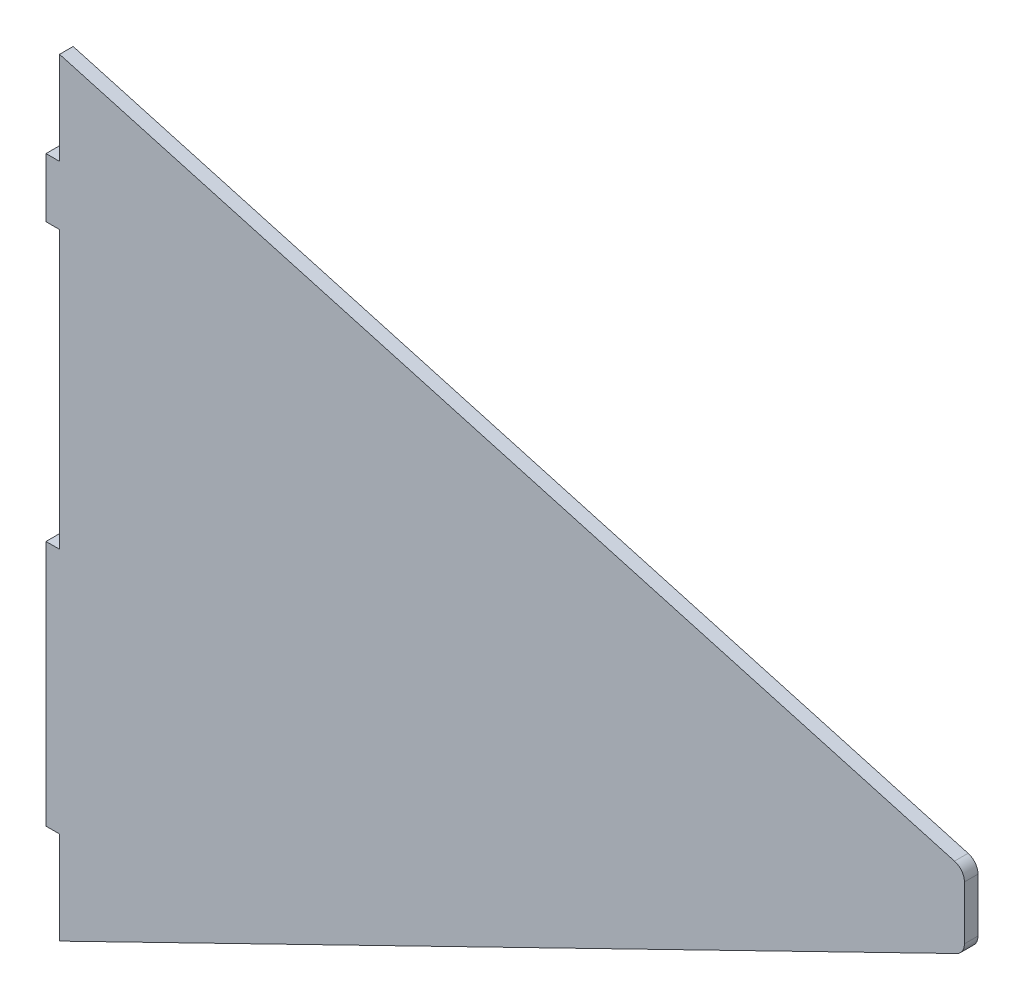
ISO-10303-21;
HEADER;
FILE_DESCRIPTION(('STEP AP214'),'2;1');
FILE_NAME('part.step','',(''),(''),'','','');
FILE_SCHEMA(('AUTOMOTIVE_DESIGN { 1 0 10303 214 1 1 1 1 }'));
ENDSEC;
DATA;
#1=APPLICATION_CONTEXT('core data for automotive mechanical design processes');
#2=APPLICATION_PROTOCOL_DEFINITION('international standard','automotive_design',2000,#1);
#3=PRODUCT_CONTEXT('',#1,'mechanical');
#4=PRODUCT('Part','Part','',(#3));
#5=PRODUCT_RELATED_PRODUCT_CATEGORY('part','',(#4));
#6=PRODUCT_DEFINITION_FORMATION('','',#4);
#7=PRODUCT_DEFINITION_CONTEXT('part definition',#1,'design');
#8=PRODUCT_DEFINITION('design','',#6,#7);
#9=PRODUCT_DEFINITION_SHAPE('','',#8);
#10=(LENGTH_UNIT() NAMED_UNIT(*) SI_UNIT(.MILLI.,.METRE.));
#11=(NAMED_UNIT(*) PLANE_ANGLE_UNIT() SI_UNIT($,.RADIAN.));
#12=(NAMED_UNIT(*) SI_UNIT($,.STERADIAN.) SOLID_ANGLE_UNIT());
#13=UNCERTAINTY_MEASURE_WITH_UNIT(LENGTH_MEASURE(1.E-05),#10,'distance_accuracy_value','');
#14=(GEOMETRIC_REPRESENTATION_CONTEXT(3) GLOBAL_UNCERTAINTY_ASSIGNED_CONTEXT((#13)) GLOBAL_UNIT_ASSIGNED_CONTEXT((#10,
#11,#12)) REPRESENTATION_CONTEXT('',''));
#15=CARTESIAN_POINT('',(0.,0.,0.));
#16=DIRECTION('',(0.,0.,1.));
#17=DIRECTION('',(1.,0.,0.));
#18=AXIS2_PLACEMENT_3D('',#15,#16,#17);
#19=CARTESIAN_POINT('',(203.,-48.8499999999948,3.));
#20=DIRECTION('',(-1.,0.,0.));
#21=DIRECTION('',(0.,-1.,0.));
#22=AXIS2_PLACEMENT_3D('',#19,#20,#21);
#23=PLANE('',#22);
#24=DIRECTION('',(0.,1.,0.));
#25=VECTOR('',#24,1.);
#26=CARTESIAN_POINT('',(203.,-48.8499999999948,0.));
#27=LINE('',#26,#25);
#28=CARTESIAN_POINT('',(203.,-46.9758424243253,0.));
#29=VERTEX_POINT('',#28);
#30=CARTESIAN_POINT('',(203.,-35.1237386171915,0.));
#31=VERTEX_POINT('',#30);
#32=EDGE_CURVE('E186',#29,#31,#27,.T.);
#33=ORIENTED_EDGE('',*,*,#32,.T.);
#34=DIRECTION('',(0.,0.,-1.));
#35=VECTOR('',#34,1.);
#36=CARTESIAN_POINT('',(203.,-35.1237386171915,3.));
#37=LINE('',#36,#35);
#38=CARTESIAN_POINT('',(203.,-35.1237386171915,3.));
#39=VERTEX_POINT('',#38);
#40=EDGE_CURVE('E58',#31,#39,#37,.F.);
#41=ORIENTED_EDGE('',*,*,#40,.T.);
#42=DIRECTION('',(0.,1.,0.));
#43=VECTOR('',#42,1.);
#44=CARTESIAN_POINT('',(203.,-48.8499999999948,3.));
#45=LINE('',#44,#43);
#46=CARTESIAN_POINT('',(203.,-46.9758424243253,3.));
#47=VERTEX_POINT('',#46);
#48=EDGE_CURVE('E149',#47,#39,#45,.T.);
#49=ORIENTED_EDGE('',*,*,#48,.F.);
#50=DIRECTION('',(0.,0.,-1.));
#51=VECTOR('',#50,1.);
#52=CARTESIAN_POINT('',(203.,-46.9758424243253,3.));
#53=LINE('',#52,#51);
#54=EDGE_CURVE('E238',#47,#29,#53,.T.);
#55=ORIENTED_EDGE('',*,*,#54,.T.);
#56=EDGE_LOOP('',(#33,#41,#49,#55));
#57=FACE_BOUND('',#56,.T.);
#58=ADVANCED_FACE('F37',(#57),#23,.F.);
#59=CARTESIAN_POINT('',(203.,-32.8499999999948,3.));
#60=DIRECTION('',(-0.270299446972253,-0.962776302661472,0.));
#61=DIRECTION('',(0.962776302661472,-0.270299446972253,0.));
#62=AXIS2_PLACEMENT_3D('',#59,#60,#61);
#63=PLANE('',#62);
#64=DIRECTION('',(-0.962776302661472,0.270299446972253,0.));
#65=VECTOR('',#64,1.);
#66=CARTESIAN_POINT('',(203.,-32.8499999999948,3.));
#67=LINE('',#66,#65);
#68=CARTESIAN_POINT('',(200.810898340917,-32.2354097092071,3.));
#69=VERTEX_POINT('',#68);
#70=CARTESIAN_POINT('',(3.,23.3000000000144,3.));
#71=VERTEX_POINT('',#70);
#72=EDGE_CURVE('E139',#69,#71,#67,.T.);
#73=ORIENTED_EDGE('',*,*,#72,.F.);
#74=DIRECTION('',(0.,0.,-1.));
#75=VECTOR('',#74,1.);
#76=CARTESIAN_POINT('',(200.810898340917,-32.2354097092071,3.));
#77=LINE('',#76,#75);
#78=CARTESIAN_POINT('',(200.810898340917,-32.2354097092071,0.));
#79=VERTEX_POINT('',#78);
#80=EDGE_CURVE('E158',#69,#79,#77,.T.);
#81=ORIENTED_EDGE('',*,*,#80,.T.);
#82=DIRECTION('',(-0.962776302661472,0.270299446972253,0.));
#83=VECTOR('',#82,1.);
#84=CARTESIAN_POINT('',(203.,-32.8499999999948,0.));
#85=LINE('',#84,#83);
#86=CARTESIAN_POINT('',(3.,23.3000000000144,0.));
#87=VERTEX_POINT('',#86);
#88=EDGE_CURVE('E155',#79,#87,#85,.T.);
#89=ORIENTED_EDGE('',*,*,#88,.T.);
#90=DIRECTION('',(0.,0.,-1.));
#91=VECTOR('',#90,1.);
#92=CARTESIAN_POINT('',(3.,23.3000000000144,3.));
#93=LINE('',#92,#91);
#94=EDGE_CURVE('E152',#71,#87,#93,.T.);
#95=ORIENTED_EDGE('',*,*,#94,.F.);
#96=EDGE_LOOP('',(#73,#81,#89,#95));
#97=FACE_BOUND('',#96,.T.);
#98=ADVANCED_FACE('F153',(#97),#63,.F.);
#99=CARTESIAN_POINT('',(3.,23.3000000000144,3.));
#100=DIRECTION('',(1.,0.,0.));
#101=DIRECTION('',(0.,1.,0.));
#102=AXIS2_PLACEMENT_3D('',#99,#100,#101);
#103=PLANE('',#102);
#104=DIRECTION('',(0.,-1.,0.));
#105=VECTOR('',#104,1.);
#106=CARTESIAN_POINT('',(3.,23.3000000000144,0.));
#107=LINE('',#106,#105);
#108=CARTESIAN_POINT('',(2.99999999999999,2.80000000001442,0.));
#109=VERTEX_POINT('',#108);
#110=EDGE_CURVE('E189',#87,#109,#107,.T.);
#111=ORIENTED_EDGE('',*,*,#110,.T.);
#112=DIRECTION('',(0.,0.,-1.));
#113=VECTOR('',#112,1.);
#114=CARTESIAN_POINT('',(2.99999999999999,2.80000000001442,3.));
#115=LINE('',#114,#113);
#116=CARTESIAN_POINT('',(2.99999999999999,2.80000000001442,3.));
#117=VERTEX_POINT('',#116);
#118=EDGE_CURVE('E159',#117,#109,#115,.T.);
#119=ORIENTED_EDGE('',*,*,#118,.F.);
#120=DIRECTION('',(0.,-1.,0.));
#121=VECTOR('',#120,1.);
#122=CARTESIAN_POINT('',(3.,23.3000000000144,3.));
#123=LINE('',#122,#121);
#124=EDGE_CURVE('E143',#71,#117,#123,.T.);
#125=ORIENTED_EDGE('',*,*,#124,.F.);
#126=ORIENTED_EDGE('',*,*,#94,.T.);
#127=EDGE_LOOP('',(#111,#119,#125,#126));
#128=FACE_BOUND('',#127,.T.);
#129=ADVANCED_FACE('F161',(#128),#103,.F.);
#130=CARTESIAN_POINT('',(2.99999999999999,2.80000000001442,3.));
#131=DIRECTION('',(0.,-1.,0.));
#132=DIRECTION('',(0.,0.,-1.));
#133=AXIS2_PLACEMENT_3D('',#130,#131,#132);
#134=PLANE('',#133);
#135=DIRECTION('',(-1.,0.,0.));
#136=VECTOR('',#135,1.);
#137=CARTESIAN_POINT('',(2.99999999999999,2.80000000001442,0.));
#138=LINE('',#137,#136);
#139=CARTESIAN_POINT('',(0.,2.80000000001442,0.));
#140=VERTEX_POINT('',#139);
#141=EDGE_CURVE('E191',#109,#140,#138,.T.);
#142=ORIENTED_EDGE('',*,*,#141,.T.);
#143=DIRECTION('',(0.,0.,-1.));
#144=VECTOR('',#143,1.);
#145=CARTESIAN_POINT('',(0.,2.80000000001442,3.));
#146=LINE('',#145,#144);
#147=CARTESIAN_POINT('',(0.,2.80000000001442,3.));
#148=VERTEX_POINT('',#147);
#149=EDGE_CURVE('E229',#148,#140,#146,.T.);
#150=ORIENTED_EDGE('',*,*,#149,.F.);
#151=DIRECTION('',(-1.,0.,0.));
#152=VECTOR('',#151,1.);
#153=CARTESIAN_POINT('',(2.99999999999999,2.80000000001442,3.));
#154=LINE('',#153,#152);
#155=EDGE_CURVE('E164',#117,#148,#154,.T.);
#156=ORIENTED_EDGE('',*,*,#155,.F.);
#157=ORIENTED_EDGE('',*,*,#118,.T.);
#158=EDGE_LOOP('',(#142,#150,#156,#157));
#159=FACE_BOUND('',#158,.T.);
#160=ADVANCED_FACE('F289',(#159),#134,.F.);
#161=CARTESIAN_POINT('',(0.,2.80000000001442,3.));
#162=DIRECTION('',(1.,0.,0.));
#163=DIRECTION('',(0.,1.,0.));
#164=AXIS2_PLACEMENT_3D('',#161,#162,#163);
#165=PLANE('',#164);
#166=DIRECTION('',(0.,-1.,0.));
#167=VECTOR('',#166,1.);
#168=CARTESIAN_POINT('',(0.,2.80000000001442,0.));
#169=LINE('',#168,#167);
#170=CARTESIAN_POINT('',(0.,-10.2499999999947,0.));
#171=VERTEX_POINT('',#170);
#172=EDGE_CURVE('E193',#140,#171,#169,.T.);
#173=ORIENTED_EDGE('',*,*,#172,.T.);
#174=DIRECTION('',(0.,0.,-1.));
#175=VECTOR('',#174,1.);
#176=CARTESIAN_POINT('',(0.,-10.2499999999947,3.));
#177=LINE('',#176,#175);
#178=CARTESIAN_POINT('',(0.,-10.2499999999947,3.));
#179=VERTEX_POINT('',#178);
#180=EDGE_CURVE('E226',#179,#171,#177,.T.);
#181=ORIENTED_EDGE('',*,*,#180,.F.);
#182=DIRECTION('',(0.,-1.,0.));
#183=VECTOR('',#182,1.);
#184=CARTESIAN_POINT('',(0.,2.80000000001442,3.));
#185=LINE('',#184,#183);
#186=EDGE_CURVE('E166',#148,#179,#185,.T.);
#187=ORIENTED_EDGE('',*,*,#186,.F.);
#188=ORIENTED_EDGE('',*,*,#149,.T.);
#189=EDGE_LOOP('',(#173,#181,#187,#188));
#190=FACE_BOUND('',#189,.T.);
#191=ADVANCED_FACE('F285',(#190),#165,.F.);
#192=CARTESIAN_POINT('',(0.,-10.2499999999947,3.));
#193=DIRECTION('',(0.,1.,0.));
#194=DIRECTION('',(0.,0.,1.));
#195=AXIS2_PLACEMENT_3D('',#192,#193,#194);
#196=PLANE('',#195);
#197=DIRECTION('',(1.,0.,0.));
#198=VECTOR('',#197,1.);
#199=CARTESIAN_POINT('',(0.,-10.2499999999947,0.));
#200=LINE('',#199,#198);
#201=CARTESIAN_POINT('',(3.,-10.2499999999947,0.));
#202=VERTEX_POINT('',#201);
#203=EDGE_CURVE('E195',#171,#202,#200,.T.);
#204=ORIENTED_EDGE('',*,*,#203,.T.);
#205=DIRECTION('',(0.,0.,-1.));
#206=VECTOR('',#205,1.);
#207=CARTESIAN_POINT('',(3.,-10.2499999999947,3.));
#208=LINE('',#207,#206);
#209=CARTESIAN_POINT('',(3.,-10.2499999999947,3.));
#210=VERTEX_POINT('',#209);
#211=EDGE_CURVE('E223',#210,#202,#208,.T.);
#212=ORIENTED_EDGE('',*,*,#211,.F.);
#213=DIRECTION('',(1.,0.,0.));
#214=VECTOR('',#213,1.);
#215=CARTESIAN_POINT('',(0.,-10.2499999999947,3.));
#216=LINE('',#215,#214);
#217=EDGE_CURVE('E171',#179,#210,#216,.T.);
#218=ORIENTED_EDGE('',*,*,#217,.F.);
#219=ORIENTED_EDGE('',*,*,#180,.T.);
#220=EDGE_LOOP('',(#204,#212,#218,#219));
#221=FACE_BOUND('',#220,.T.);
#222=ADVANCED_FACE('F281',(#221),#196,.F.);
#223=CARTESIAN_POINT('',(3.,-10.2499999999947,3.));
#224=DIRECTION('',(1.,0.,0.));
#225=DIRECTION('',(0.,1.,0.));
#226=AXIS2_PLACEMENT_3D('',#223,#224,#225);
#227=PLANE('',#226);
#228=DIRECTION('',(0.,-1.,0.));
#229=VECTOR('',#228,1.);
#230=CARTESIAN_POINT('',(3.,-10.2499999999947,0.));
#231=LINE('',#230,#229);
#232=CARTESIAN_POINT('',(3.,-71.4499999999946,0.));
#233=VERTEX_POINT('',#232);
#234=EDGE_CURVE('E197',#202,#233,#231,.T.);
#235=ORIENTED_EDGE('',*,*,#234,.T.);
#236=DIRECTION('',(0.,0.,-1.));
#237=VECTOR('',#236,1.);
#238=CARTESIAN_POINT('',(3.,-71.4499999999946,3.));
#239=LINE('',#238,#237);
#240=CARTESIAN_POINT('',(3.,-71.4499999999946,3.));
#241=VERTEX_POINT('',#240);
#242=EDGE_CURVE('E220',#241,#233,#239,.T.);
#243=ORIENTED_EDGE('',*,*,#242,.F.);
#244=DIRECTION('',(0.,-1.,0.));
#245=VECTOR('',#244,1.);
#246=CARTESIAN_POINT('',(3.,-10.2499999999947,3.));
#247=LINE('',#246,#245);
#248=EDGE_CURVE('E173',#210,#241,#247,.T.);
#249=ORIENTED_EDGE('',*,*,#248,.F.);
#250=ORIENTED_EDGE('',*,*,#211,.T.);
#251=EDGE_LOOP('',(#235,#243,#249,#250));
#252=FACE_BOUND('',#251,.T.);
#253=ADVANCED_FACE('F276',(#252),#227,.F.);
#254=CARTESIAN_POINT('',(3.,-71.4499999999946,3.));
#255=DIRECTION('',(0.,-1.,0.));
#256=DIRECTION('',(0.,0.,-1.));
#257=AXIS2_PLACEMENT_3D('',#254,#255,#256);
#258=PLANE('',#257);
#259=DIRECTION('',(-1.,0.,0.));
#260=VECTOR('',#259,1.);
#261=CARTESIAN_POINT('',(3.,-71.4499999999946,0.));
#262=LINE('',#261,#260);
#263=CARTESIAN_POINT('',(0.,-71.4499999999946,0.));
#264=VERTEX_POINT('',#263);
#265=EDGE_CURVE('E199',#233,#264,#262,.T.);
#266=ORIENTED_EDGE('',*,*,#265,.T.);
#267=DIRECTION('',(0.,0.,-1.));
#268=VECTOR('',#267,1.);
#269=CARTESIAN_POINT('',(0.,-71.4499999999946,3.));
#270=LINE('',#269,#268);
#271=CARTESIAN_POINT('',(0.,-71.4499999999946,3.));
#272=VERTEX_POINT('',#271);
#273=EDGE_CURVE('E217',#272,#264,#270,.T.);
#274=ORIENTED_EDGE('',*,*,#273,.F.);
#275=DIRECTION('',(-1.,0.,0.));
#276=VECTOR('',#275,1.);
#277=CARTESIAN_POINT('',(3.,-71.4499999999946,3.));
#278=LINE('',#277,#276);
#279=EDGE_CURVE('E175',#241,#272,#278,.T.);
#280=ORIENTED_EDGE('',*,*,#279,.F.);
#281=ORIENTED_EDGE('',*,*,#242,.T.);
#282=EDGE_LOOP('',(#266,#274,#280,#281));
#283=FACE_BOUND('',#282,.T.);
#284=ADVANCED_FACE('F270',(#283),#258,.F.);
#285=CARTESIAN_POINT('',(0.,-71.4499999999946,3.));
#286=DIRECTION('',(1.,0.,0.));
#287=DIRECTION('',(0.,1.,0.));
#288=AXIS2_PLACEMENT_3D('',#285,#286,#287);
#289=PLANE('',#288);
#290=DIRECTION('',(0.,-1.,0.));
#291=VECTOR('',#290,1.);
#292=CARTESIAN_POINT('',(0.,-71.4499999999946,0.));
#293=LINE('',#292,#291);
#294=CARTESIAN_POINT('',(0.,-125.949999999995,0.));
#295=VERTEX_POINT('',#294);
#296=EDGE_CURVE('E201',#264,#295,#293,.T.);
#297=ORIENTED_EDGE('',*,*,#296,.T.);
#298=DIRECTION('',(0.,0.,-1.));
#299=VECTOR('',#298,1.);
#300=CARTESIAN_POINT('',(0.,-125.949999999995,3.));
#301=LINE('',#300,#299);
#302=CARTESIAN_POINT('',(0.,-125.949999999995,3.));
#303=VERTEX_POINT('',#302);
#304=EDGE_CURVE('E214',#303,#295,#301,.T.);
#305=ORIENTED_EDGE('',*,*,#304,.F.);
#306=DIRECTION('',(0.,-1.,0.));
#307=VECTOR('',#306,1.);
#308=CARTESIAN_POINT('',(0.,-71.4499999999946,3.));
#309=LINE('',#308,#307);
#310=EDGE_CURVE('E177',#272,#303,#309,.T.);
#311=ORIENTED_EDGE('',*,*,#310,.F.);
#312=ORIENTED_EDGE('',*,*,#273,.T.);
#313=EDGE_LOOP('',(#297,#305,#311,#312));
#314=FACE_BOUND('',#313,.T.);
#315=ADVANCED_FACE('F266',(#314),#289,.F.);
#316=CARTESIAN_POINT('',(0.,-125.949999999995,3.));
#317=DIRECTION('',(0.,1.,0.));
#318=DIRECTION('',(0.,0.,1.));
#319=AXIS2_PLACEMENT_3D('',#316,#317,#318);
#320=PLANE('',#319);
#321=DIRECTION('',(1.,0.,0.));
#322=VECTOR('',#321,1.);
#323=CARTESIAN_POINT('',(0.,-125.949999999995,0.));
#324=LINE('',#323,#322);
#325=CARTESIAN_POINT('',(3.00000000000001,-125.949999999995,0.));
#326=VERTEX_POINT('',#325);
#327=EDGE_CURVE('E203',#295,#326,#324,.T.);
#328=ORIENTED_EDGE('',*,*,#327,.T.);
#329=DIRECTION('',(0.,0.,-1.));
#330=VECTOR('',#329,1.);
#331=CARTESIAN_POINT('',(3.00000000000001,-125.949999999995,3.));
#332=LINE('',#331,#330);
#333=CARTESIAN_POINT('',(3.00000000000001,-125.949999999995,3.));
#334=VERTEX_POINT('',#333);
#335=EDGE_CURVE('E211',#334,#326,#332,.T.);
#336=ORIENTED_EDGE('',*,*,#335,.F.);
#337=DIRECTION('',(1.,0.,0.));
#338=VECTOR('',#337,1.);
#339=CARTESIAN_POINT('',(0.,-125.949999999995,3.));
#340=LINE('',#339,#338);
#341=EDGE_CURVE('E179',#303,#334,#340,.T.);
#342=ORIENTED_EDGE('',*,*,#341,.F.);
#343=ORIENTED_EDGE('',*,*,#304,.T.);
#344=EDGE_LOOP('',(#328,#336,#342,#343));
#345=FACE_BOUND('',#344,.T.);
#346=ADVANCED_FACE('F261',(#345),#320,.F.);
#347=CARTESIAN_POINT('',(3.00000000000001,-125.949999999995,3.));
#348=DIRECTION('',(1.,0.,0.));
#349=DIRECTION('',(0.,1.,0.));
#350=AXIS2_PLACEMENT_3D('',#347,#348,#349);
#351=PLANE('',#350);
#352=DIRECTION('',(0.,-1.,0.));
#353=VECTOR('',#352,1.);
#354=CARTESIAN_POINT('',(3.00000000000001,-125.949999999995,0.));
#355=LINE('',#354,#353);
#356=CARTESIAN_POINT('',(2.99999999999997,-146.449999999995,0.));
#357=VERTEX_POINT('',#356);
#358=EDGE_CURVE('E205',#326,#357,#355,.T.);
#359=ORIENTED_EDGE('',*,*,#358,.T.);
#360=DIRECTION('',(0.,0.,-1.));
#361=VECTOR('',#360,1.);
#362=CARTESIAN_POINT('',(2.99999999999997,-146.449999999995,3.));
#363=LINE('',#362,#361);
#364=CARTESIAN_POINT('',(2.99999999999997,-146.449999999995,3.));
#365=VERTEX_POINT('',#364);
#366=EDGE_CURVE('E185',#365,#357,#363,.T.);
#367=ORIENTED_EDGE('',*,*,#366,.F.);
#368=DIRECTION('',(0.,-1.,0.));
#369=VECTOR('',#368,1.);
#370=CARTESIAN_POINT('',(3.00000000000001,-125.949999999995,3.));
#371=LINE('',#370,#369);
#372=EDGE_CURVE('E181',#334,#365,#371,.T.);
#373=ORIENTED_EDGE('',*,*,#372,.F.);
#374=ORIENTED_EDGE('',*,*,#335,.T.);
#375=EDGE_LOOP('',(#359,#367,#373,#374));
#376=FACE_BOUND('',#375,.T.);
#377=ADVANCED_FACE('F255',(#376),#351,.F.);
#378=CARTESIAN_POINT('',(2.99999999999997,-146.449999999995,3.));
#379=DIRECTION('',(-0.438565276447849,0.898699336983299,0.));
#380=DIRECTION('',(-0.898699336983299,-0.438565276447849,0.));
#381=AXIS2_PLACEMENT_3D('',#378,#379,#380);
#382=PLANE('',#381);
#383=DIRECTION('',(0.898699336983299,0.438565276447849,0.));
#384=VECTOR('',#383,1.);
#385=CARTESIAN_POINT('',(2.99999999999997,-146.449999999995,0.));
#386=LINE('',#385,#384);
#387=CARTESIAN_POINT('',(201.315695829344,-49.6719404352752,0.));
#388=VERTEX_POINT('',#387);
#389=EDGE_CURVE('E207',#357,#388,#386,.T.);
#390=ORIENTED_EDGE('',*,*,#389,.T.);
#391=DIRECTION('',(0.,0.,-1.));
#392=VECTOR('',#391,1.);
#393=CARTESIAN_POINT('',(201.315695829344,-49.6719404352752,3.));
#394=LINE('',#393,#392);
#395=CARTESIAN_POINT('',(201.315695829344,-49.6719404352752,3.));
#396=VERTEX_POINT('',#395);
#397=EDGE_CURVE('E11',#388,#396,#394,.F.);
#398=ORIENTED_EDGE('',*,*,#397,.T.);
#399=DIRECTION('',(0.898699336983299,0.438565276447849,0.));
#400=VECTOR('',#399,1.);
#401=CARTESIAN_POINT('',(2.99999999999997,-146.449999999995,3.));
#402=LINE('',#401,#400);
#403=EDGE_CURVE('E183',#365,#396,#402,.T.);
#404=ORIENTED_EDGE('',*,*,#403,.F.);
#405=ORIENTED_EDGE('',*,*,#366,.T.);
#406=EDGE_LOOP('',(#390,#398,#404,#405));
#407=FACE_BOUND('',#406,.T.);
#408=ADVANCED_FACE('F251',(#407),#382,.F.);
#409=CARTESIAN_POINT('',(0.,0.,3.));
#410=DIRECTION('',(0.,0.,1.));
#411=DIRECTION('',(1.,0.,0.));
#412=AXIS2_PLACEMENT_3D('',#409,#410,#411);
#413=PLANE('',#412);
#414=ORIENTED_EDGE('',*,*,#48,.T.);
#415=CARTESIAN_POINT('',(200.,-35.1237386171915,3.));
#416=DIRECTION('',(0.,0.,1.));
#417=DIRECTION('',(1.,0.,0.));
#418=AXIS2_PLACEMENT_3D('',#415,#416,#417);
#419=CIRCLE('',#418,3.);
#420=EDGE_CURVE('E45',#39,#69,#419,.T.);
#421=ORIENTED_EDGE('',*,*,#420,.T.);
#422=ORIENTED_EDGE('',*,*,#72,.T.);
#423=ORIENTED_EDGE('',*,*,#124,.T.);
#424=ORIENTED_EDGE('',*,*,#155,.T.);
#425=ORIENTED_EDGE('',*,*,#186,.T.);
#426=ORIENTED_EDGE('',*,*,#217,.T.);
#427=ORIENTED_EDGE('',*,*,#248,.T.);
#428=ORIENTED_EDGE('',*,*,#279,.T.);
#429=ORIENTED_EDGE('',*,*,#310,.T.);
#430=ORIENTED_EDGE('',*,*,#341,.T.);
#431=ORIENTED_EDGE('',*,*,#372,.T.);
#432=ORIENTED_EDGE('',*,*,#403,.T.);
#433=CARTESIAN_POINT('',(200.,-46.9758424243253,3.));
#434=DIRECTION('',(0.,0.,1.));
#435=DIRECTION('',(1.,0.,0.));
#436=AXIS2_PLACEMENT_3D('',#433,#434,#435);
#437=CIRCLE('',#436,3.);
#438=EDGE_CURVE('E242',#396,#47,#437,.T.);
#439=ORIENTED_EDGE('',*,*,#438,.T.);
#440=EDGE_LOOP('',(#414,#421,#422,#423,#424,#425,#426,#427,#428,#429,#430,#431,#432,#439));
#441=FACE_BOUND('',#440,.T.);
#442=ADVANCED_FACE('F141',(#441),#413,.T.);
#443=CARTESIAN_POINT('',(0.,0.,0.));
#444=DIRECTION('',(0.,0.,1.));
#445=DIRECTION('',(1.,0.,0.));
#446=AXIS2_PLACEMENT_3D('',#443,#444,#445);
#447=PLANE('',#446);
#448=ORIENTED_EDGE('',*,*,#88,.F.);
#449=CARTESIAN_POINT('',(200.,-35.1237386171915,0.));
#450=DIRECTION('',(0.,0.,1.));
#451=DIRECTION('',(1.,0.,0.));
#452=AXIS2_PLACEMENT_3D('',#449,#450,#451);
#453=CIRCLE('',#452,3.);
#454=EDGE_CURVE('E236',#79,#31,#453,.F.);
#455=ORIENTED_EDGE('',*,*,#454,.T.);
#456=ORIENTED_EDGE('',*,*,#32,.F.);
#457=CARTESIAN_POINT('',(200.,-46.9758424243253,0.));
#458=DIRECTION('',(0.,0.,1.));
#459=DIRECTION('',(1.,0.,0.));
#460=AXIS2_PLACEMENT_3D('',#457,#458,#459);
#461=CIRCLE('',#460,3.);
#462=EDGE_CURVE('E234',#29,#388,#461,.F.);
#463=ORIENTED_EDGE('',*,*,#462,.T.);
#464=ORIENTED_EDGE('',*,*,#389,.F.);
#465=ORIENTED_EDGE('',*,*,#358,.F.);
#466=ORIENTED_EDGE('',*,*,#327,.F.);
#467=ORIENTED_EDGE('',*,*,#296,.F.);
#468=ORIENTED_EDGE('',*,*,#265,.F.);
#469=ORIENTED_EDGE('',*,*,#234,.F.);
#470=ORIENTED_EDGE('',*,*,#203,.F.);
#471=ORIENTED_EDGE('',*,*,#172,.F.);
#472=ORIENTED_EDGE('',*,*,#141,.F.);
#473=ORIENTED_EDGE('',*,*,#110,.F.);
#474=EDGE_LOOP('',(#448,#455,#456,#463,#464,#465,#466,#467,#468,#469,#470,#471,#472,#473));
#475=FACE_BOUND('',#474,.T.);
#476=ADVANCED_FACE('F249',(#475),#447,.F.);
#477=CARTESIAN_POINT('',(200.,-35.1237386171915,3.));
#478=DIRECTION('',(0.,0.,-1.));
#479=DIRECTION('',(-1.,0.,0.));
#480=AXIS2_PLACEMENT_3D('',#477,#478,#479);
#481=CYLINDRICAL_SURFACE('',#480,3.);
#482=ORIENTED_EDGE('',*,*,#420,.F.);
#483=ORIENTED_EDGE('',*,*,#40,.F.);
#484=ORIENTED_EDGE('',*,*,#454,.F.);
#485=ORIENTED_EDGE('',*,*,#80,.F.);
#486=EDGE_LOOP('',(#482,#483,#484,#485));
#487=FACE_BOUND('',#486,.T.);
#488=ADVANCED_FACE('F305',(#487),#481,.T.);
#489=CARTESIAN_POINT('',(200.,-46.9758424243253,3.));
#490=DIRECTION('',(0.,0.,-1.));
#491=DIRECTION('',(-1.,0.,0.));
#492=AXIS2_PLACEMENT_3D('',#489,#490,#491);
#493=CYLINDRICAL_SURFACE('',#492,3.);
#494=ORIENTED_EDGE('',*,*,#438,.F.);
#495=ORIENTED_EDGE('',*,*,#397,.F.);
#496=ORIENTED_EDGE('',*,*,#462,.F.);
#497=ORIENTED_EDGE('',*,*,#54,.F.);
#498=EDGE_LOOP('',(#494,#495,#496,#497));
#499=FACE_BOUND('',#498,.T.);
#500=ADVANCED_FACE('F39',(#499),#493,.T.);
#501=CLOSED_SHELL('',(#58,#98,#129,#160,#191,#222,#253,#284,#315,#346,#377,#408,#442,#476,#488,#500));
#502=MANIFOLD_SOLID_BREP('B2',#501);
#503=ADVANCED_BREP_SHAPE_REPRESENTATION('',(#18,#502),#14);
#504=SHAPE_DEFINITION_REPRESENTATION(#9,#503);
ENDSEC;
END-ISO-10303-21;
